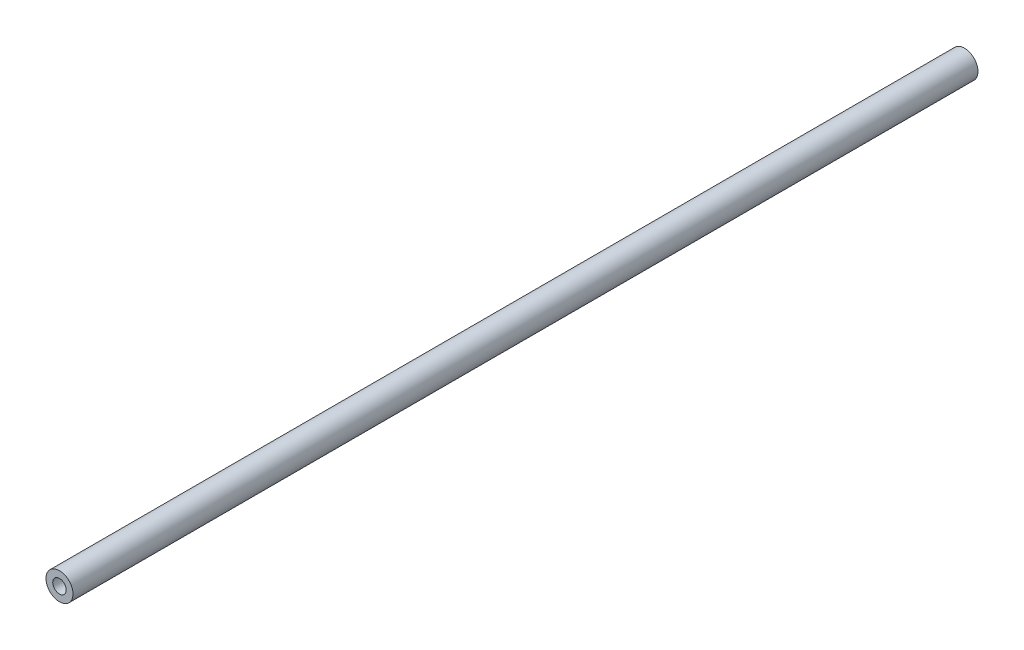
ISO-10303-21;
HEADER;
FILE_DESCRIPTION(('STEP AP214'),'2;1');
FILE_NAME('part.step','',(''),(''),'','','');
FILE_SCHEMA(('AUTOMOTIVE_DESIGN { 1 0 10303 214 1 1 1 1 }'));
ENDSEC;
DATA;
#1=APPLICATION_CONTEXT('core data for automotive mechanical design processes');
#2=APPLICATION_PROTOCOL_DEFINITION('international standard','automotive_design',2000,#1);
#3=PRODUCT_CONTEXT('',#1,'mechanical');
#4=PRODUCT('Part','Part','',(#3));
#5=PRODUCT_RELATED_PRODUCT_CATEGORY('part','',(#4));
#6=PRODUCT_DEFINITION_FORMATION('','',#4);
#7=PRODUCT_DEFINITION_CONTEXT('part definition',#1,'design');
#8=PRODUCT_DEFINITION('design','',#6,#7);
#9=PRODUCT_DEFINITION_SHAPE('','',#8);
#10=(LENGTH_UNIT() NAMED_UNIT(*) SI_UNIT(.MILLI.,.METRE.));
#11=(NAMED_UNIT(*) PLANE_ANGLE_UNIT() SI_UNIT($,.RADIAN.));
#12=(NAMED_UNIT(*) SI_UNIT($,.STERADIAN.) SOLID_ANGLE_UNIT());
#13=UNCERTAINTY_MEASURE_WITH_UNIT(LENGTH_MEASURE(1.E-05),#10,'distance_accuracy_value','');
#14=(GEOMETRIC_REPRESENTATION_CONTEXT(3) GLOBAL_UNCERTAINTY_ASSIGNED_CONTEXT((#13)) GLOBAL_UNIT_ASSIGNED_CONTEXT((#10,
#11,#12)) REPRESENTATION_CONTEXT('',''));
#15=CARTESIAN_POINT('',(0.,0.,0.));
#16=DIRECTION('',(0.,0.,1.));
#17=DIRECTION('',(1.,0.,0.));
#18=AXIS2_PLACEMENT_3D('',#15,#16,#17);
#19=CARTESIAN_POINT('',(0.,0.,335.));
#20=DIRECTION('',(0.,0.,-1.));
#21=DIRECTION('',(-1.,0.,0.));
#22=AXIS2_PLACEMENT_3D('',#19,#20,#21);
#23=CYLINDRICAL_SURFACE('',#22,5.);
#24=CARTESIAN_POINT('',(0.,0.,335.));
#25=DIRECTION('',(0.,0.,1.));
#26=DIRECTION('',(1.,0.,0.));
#27=AXIS2_PLACEMENT_3D('',#24,#25,#26);
#28=CIRCLE('',#27,5.);
#29=CARTESIAN_POINT('',(5.,0.,335.));
#30=VERTEX_POINT('',#29);
#31=EDGE_CURVE('E10',#30,#30,#28,.T.);
#32=ORIENTED_EDGE('',*,*,#31,.F.);
#33=EDGE_LOOP('',(#32));
#34=FACE_BOUND('',#33,.T.);
#35=CARTESIAN_POINT('',(0.,0.,0.));
#36=DIRECTION('',(0.,0.,1.));
#37=DIRECTION('',(1.,0.,0.));
#38=AXIS2_PLACEMENT_3D('',#35,#36,#37);
#39=CIRCLE('',#38,5.);
#40=CARTESIAN_POINT('',(5.,0.,0.));
#41=VERTEX_POINT('',#40);
#42=EDGE_CURVE('E34',#41,#41,#39,.T.);
#43=ORIENTED_EDGE('',*,*,#42,.T.);
#44=EDGE_LOOP('',(#43));
#45=FACE_BOUND('',#44,.T.);
#46=ADVANCED_FACE('F31',(#34,#45),#23,.T.);
#47=CARTESIAN_POINT('',(0.,0.,335.));
#48=DIRECTION('',(0.,0.,1.));
#49=DIRECTION('',(1.,0.,0.));
#50=AXIS2_PLACEMENT_3D('',#47,#48,#49);
#51=PLANE('',#50);
#52=CARTESIAN_POINT('',(0.,0.,335.));
#53=DIRECTION('',(0.,0.,1.));
#54=DIRECTION('',(1.,0.,0.));
#55=AXIS2_PLACEMENT_3D('',#52,#53,#54);
#56=CIRCLE('',#55,2.5);
#57=CARTESIAN_POINT('',(2.5,0.,335.));
#58=VERTEX_POINT('',#57);
#59=EDGE_CURVE('E49',#58,#58,#56,.T.);
#60=ORIENTED_EDGE('',*,*,#59,.F.);
#61=EDGE_LOOP('',(#60));
#62=FACE_BOUND('',#61,.T.);
#63=ORIENTED_EDGE('',*,*,#31,.T.);
#64=EDGE_LOOP('',(#63));
#65=FACE_BOUND('',#64,.T.);
#66=ADVANCED_FACE('F64',(#62,#65),#51,.T.);
#67=CARTESIAN_POINT('',(0.,0.,0.));
#68=DIRECTION('',(0.,0.,1.));
#69=DIRECTION('',(1.,0.,0.));
#70=AXIS2_PLACEMENT_3D('',#67,#68,#69);
#71=PLANE('',#70);
#72=CARTESIAN_POINT('',(0.,0.,0.));
#73=DIRECTION('',(0.,0.,1.));
#74=DIRECTION('',(1.,0.,0.));
#75=AXIS2_PLACEMENT_3D('',#72,#73,#74);
#76=CIRCLE('',#75,2.5);
#77=CARTESIAN_POINT('',(2.5,0.,0.));
#78=VERTEX_POINT('',#77);
#79=EDGE_CURVE('E43',#78,#78,#76,.T.);
#80=ORIENTED_EDGE('',*,*,#79,.T.);
#81=EDGE_LOOP('',(#80));
#82=FACE_BOUND('',#81,.T.);
#83=ORIENTED_EDGE('',*,*,#42,.F.);
#84=EDGE_LOOP('',(#83));
#85=FACE_BOUND('',#84,.T.);
#86=ADVANCED_FACE('F66',(#82,#85),#71,.F.);
#87=CARTESIAN_POINT('',(0.,0.,17.));
#88=DIRECTION('',(0.,0.,-1.));
#89=DIRECTION('',(-1.,0.,0.));
#90=AXIS2_PLACEMENT_3D('',#87,#88,#89);
#91=CYLINDRICAL_SURFACE('',#90,2.5);
#92=CARTESIAN_POINT('',(0.,0.,17.));
#93=DIRECTION('',(0.,0.,1.));
#94=DIRECTION('',(1.,0.,0.));
#95=AXIS2_PLACEMENT_3D('',#92,#93,#94);
#96=CIRCLE('',#95,2.5);
#97=CARTESIAN_POINT('',(2.5,0.,17.));
#98=VERTEX_POINT('',#97);
#99=EDGE_CURVE('E41',#98,#98,#96,.T.);
#100=ORIENTED_EDGE('',*,*,#99,.T.);
#101=EDGE_LOOP('',(#100));
#102=FACE_BOUND('',#101,.T.);
#103=ORIENTED_EDGE('',*,*,#79,.F.);
#104=EDGE_LOOP('',(#103));
#105=FACE_BOUND('',#104,.T.);
#106=ADVANCED_FACE('F72',(#102,#105),#91,.F.);
#107=CARTESIAN_POINT('',(0.,0.,17.));
#108=DIRECTION('',(0.,0.,1.));
#109=DIRECTION('',(1.,0.,0.));
#110=AXIS2_PLACEMENT_3D('',#107,#108,#109);
#111=PLANE('',#110);
#112=ORIENTED_EDGE('',*,*,#99,.F.);
#113=EDGE_LOOP('',(#112));
#114=FACE_BOUND('',#113,.T.);
#115=ADVANCED_FACE('F60',(#114),#111,.F.);
#116=CARTESIAN_POINT('',(0.,0.,318.));
#117=DIRECTION('',(0.,0.,1.));
#118=DIRECTION('',(1.,0.,0.));
#119=AXIS2_PLACEMENT_3D('',#116,#117,#118);
#120=CYLINDRICAL_SURFACE('',#119,2.5);
#121=CARTESIAN_POINT('',(0.,0.,318.));
#122=DIRECTION('',(0.,0.,1.));
#123=DIRECTION('',(1.,0.,0.));
#124=AXIS2_PLACEMENT_3D('',#121,#122,#123);
#125=CIRCLE('',#124,2.5);
#126=CARTESIAN_POINT('',(2.5,0.,318.));
#127=VERTEX_POINT('',#126);
#128=EDGE_CURVE('E46',#127,#127,#125,.T.);
#129=ORIENTED_EDGE('',*,*,#128,.F.);
#130=EDGE_LOOP('',(#129));
#131=FACE_BOUND('',#130,.T.);
#132=ORIENTED_EDGE('',*,*,#59,.T.);
#133=EDGE_LOOP('',(#132));
#134=FACE_BOUND('',#133,.T.);
#135=ADVANCED_FACE('F57',(#131,#134),#120,.F.);
#136=CARTESIAN_POINT('',(0.,0.,318.));
#137=DIRECTION('',(0.,0.,1.));
#138=DIRECTION('',(1.,0.,0.));
#139=AXIS2_PLACEMENT_3D('',#136,#137,#138);
#140=PLANE('',#139);
#141=ORIENTED_EDGE('',*,*,#128,.T.);
#142=EDGE_LOOP('',(#141));
#143=FACE_BOUND('',#142,.T.);
#144=ADVANCED_FACE('F55',(#143),#140,.T.);
#145=CLOSED_SHELL('',(#46,#66,#86,#106,#115,#135,#144));
#146=MANIFOLD_SOLID_BREP('B2',#145);
#147=ADVANCED_BREP_SHAPE_REPRESENTATION('',(#18,#146),#14);
#148=SHAPE_DEFINITION_REPRESENTATION(#9,#147);
ENDSEC;
END-ISO-10303-21;
